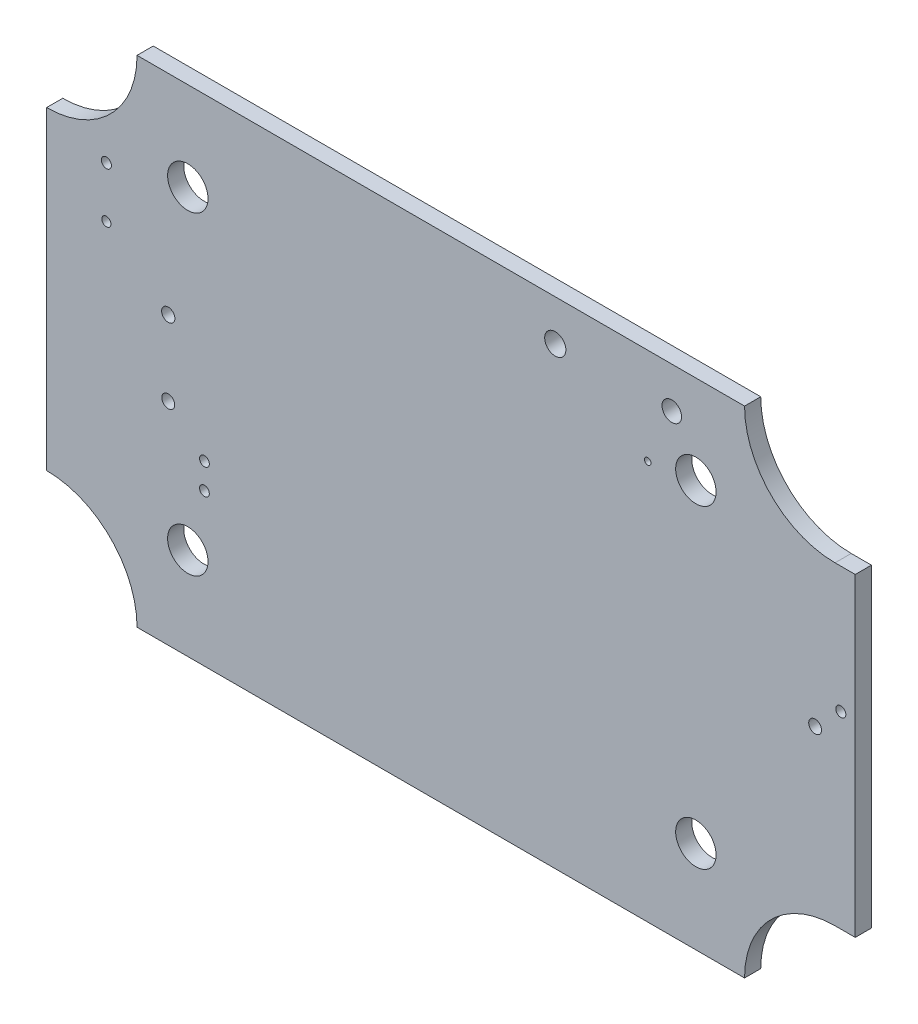
ISO-10303-21;
HEADER;
FILE_DESCRIPTION(('STEP AP214'),'2;1');
FILE_NAME('part.step','',(''),(''),'','','');
FILE_SCHEMA(('AUTOMOTIVE_DESIGN { 1 0 10303 214 1 1 1 1 }'));
ENDSEC;
DATA;
#1=APPLICATION_CONTEXT('core data for automotive mechanical design processes');
#2=APPLICATION_PROTOCOL_DEFINITION('international standard','automotive_design',2000,#1);
#3=PRODUCT_CONTEXT('',#1,'mechanical');
#4=PRODUCT('Part','Part','',(#3));
#5=PRODUCT_RELATED_PRODUCT_CATEGORY('part','',(#4));
#6=PRODUCT_DEFINITION_FORMATION('','',#4);
#7=PRODUCT_DEFINITION_CONTEXT('part definition',#1,'design');
#8=PRODUCT_DEFINITION('design','',#6,#7);
#9=PRODUCT_DEFINITION_SHAPE('','',#8);
#10=(LENGTH_UNIT() NAMED_UNIT(*) SI_UNIT(.MILLI.,.METRE.));
#11=(NAMED_UNIT(*) PLANE_ANGLE_UNIT() SI_UNIT($,.RADIAN.));
#12=(NAMED_UNIT(*) SI_UNIT($,.STERADIAN.) SOLID_ANGLE_UNIT());
#13=UNCERTAINTY_MEASURE_WITH_UNIT(LENGTH_MEASURE(1.E-05),#10,'distance_accuracy_value','');
#14=(GEOMETRIC_REPRESENTATION_CONTEXT(3) GLOBAL_UNCERTAINTY_ASSIGNED_CONTEXT((#13)) GLOBAL_UNIT_ASSIGNED_CONTEXT((#10,
#11,#12)) REPRESENTATION_CONTEXT('',''));
#15=CARTESIAN_POINT('',(0.,0.,0.));
#16=DIRECTION('',(0.,0.,1.));
#17=DIRECTION('',(1.,0.,0.));
#18=AXIS2_PLACEMENT_3D('',#15,#16,#17);
#19=CARTESIAN_POINT('',(-39.,24.5,1.6));
#20=DIRECTION('',(0.,-1.,0.));
#21=DIRECTION('',(0.,0.,-1.));
#22=AXIS2_PLACEMENT_3D('',#19,#20,#21);
#23=PLANE('',#22);
#24=DIRECTION('',(-1.,0.,0.));
#25=VECTOR('',#24,1.);
#26=CARTESIAN_POINT('',(-39.,24.5,0.));
#27=LINE('',#26,#25);
#28=CARTESIAN_POINT('',(30.0488040978267,24.5,0.));
#29=VERTEX_POINT('',#28);
#30=CARTESIAN_POINT('',(-30.0488040978267,24.5,0.));
#31=VERTEX_POINT('',#30);
#32=EDGE_CURVE('E191',#29,#31,#27,.T.);
#33=ORIENTED_EDGE('',*,*,#32,.T.);
#34=DIRECTION('',(0.,0.,1.));
#35=VECTOR('',#34,1.);
#36=CARTESIAN_POINT('',(-30.0488040978267,24.5,-8.4));
#37=LINE('',#36,#35);
#38=CARTESIAN_POINT('',(-30.0488040978267,24.5,1.6));
#39=VERTEX_POINT('',#38);
#40=EDGE_CURVE('E54',#31,#39,#37,.T.);
#41=ORIENTED_EDGE('',*,*,#40,.T.);
#42=DIRECTION('',(-1.,0.,0.));
#43=VECTOR('',#42,1.);
#44=CARTESIAN_POINT('',(-39.,24.5,1.6));
#45=LINE('',#44,#43);
#46=CARTESIAN_POINT('',(30.0488040978267,24.5,1.6));
#47=VERTEX_POINT('',#46);
#48=EDGE_CURVE('E192',#47,#39,#45,.T.);
#49=ORIENTED_EDGE('',*,*,#48,.F.);
#50=DIRECTION('',(0.,0.,1.));
#51=VECTOR('',#50,1.);
#52=CARTESIAN_POINT('',(30.0488040978267,24.5,-8.4));
#53=LINE('',#52,#51);
#54=EDGE_CURVE('E164',#47,#29,#53,.F.);
#55=ORIENTED_EDGE('',*,*,#54,.T.);
#56=EDGE_LOOP('',(#33,#41,#49,#55));
#57=FACE_BOUND('',#56,.T.);
#58=ADVANCED_FACE('F37',(#57),#23,.F.);
#59=CARTESIAN_POINT('',(-39.,24.5,1.6));
#60=DIRECTION('',(1.,0.,0.));
#61=DIRECTION('',(0.,0.,-1.));
#62=AXIS2_PLACEMENT_3D('',#59,#60,#61);
#63=PLANE('',#62);
#64=DIRECTION('',(0.,-1.,0.));
#65=VECTOR('',#64,1.);
#66=CARTESIAN_POINT('',(-39.,24.5,1.6));
#67=LINE('',#66,#65);
#68=CARTESIAN_POINT('',(-39.,15.5488040978268,1.6));
#69=VERTEX_POINT('',#68);
#70=CARTESIAN_POINT('',(-39.,-15.5488040978267,1.6));
#71=VERTEX_POINT('',#70);
#72=EDGE_CURVE('E196',#69,#71,#67,.T.);
#73=ORIENTED_EDGE('',*,*,#72,.F.);
#74=DIRECTION('',(0.,0.,1.));
#75=VECTOR('',#74,1.);
#76=CARTESIAN_POINT('',(-39.,15.5488040978268,-8.4));
#77=LINE('',#76,#75);
#78=CARTESIAN_POINT('',(-39.,15.5488040978268,0.));
#79=VERTEX_POINT('',#78);
#80=EDGE_CURVE('E178',#69,#79,#77,.F.);
#81=ORIENTED_EDGE('',*,*,#80,.T.);
#82=DIRECTION('',(0.,-1.,0.));
#83=VECTOR('',#82,1.);
#84=CARTESIAN_POINT('',(-39.,24.5,0.));
#85=LINE('',#84,#83);
#86=CARTESIAN_POINT('',(-39.,-15.5488040978267,0.));
#87=VERTEX_POINT('',#86);
#88=EDGE_CURVE('E208',#79,#87,#85,.T.);
#89=ORIENTED_EDGE('',*,*,#88,.T.);
#90=DIRECTION('',(0.,0.,1.));
#91=VECTOR('',#90,1.);
#92=CARTESIAN_POINT('',(-39.,-15.5488040978267,-8.4));
#93=LINE('',#92,#91);
#94=EDGE_CURVE('E62',#87,#71,#93,.T.);
#95=ORIENTED_EDGE('',*,*,#94,.T.);
#96=EDGE_LOOP('',(#73,#81,#89,#95));
#97=FACE_BOUND('',#96,.T.);
#98=ADVANCED_FACE('F324',(#97),#63,.F.);
#99=CARTESIAN_POINT('',(-39.,-24.5,1.6));
#100=DIRECTION('',(0.,1.,0.));
#101=DIRECTION('',(0.,0.,1.));
#102=AXIS2_PLACEMENT_3D('',#99,#100,#101);
#103=PLANE('',#102);
#104=DIRECTION('',(1.,0.,0.));
#105=VECTOR('',#104,1.);
#106=CARTESIAN_POINT('',(-39.,-24.5,0.));
#107=LINE('',#106,#105);
#108=CARTESIAN_POINT('',(-30.0488040978267,-24.5,0.));
#109=VERTEX_POINT('',#108);
#110=CARTESIAN_POINT('',(30.0488040978267,-24.5,0.));
#111=VERTEX_POINT('',#110);
#112=EDGE_CURVE('E197',#109,#111,#107,.T.);
#113=ORIENTED_EDGE('',*,*,#112,.T.);
#114=DIRECTION('',(0.,0.,1.));
#115=VECTOR('',#114,1.);
#116=CARTESIAN_POINT('',(30.0488040978267,-24.5,-8.4));
#117=LINE('',#116,#115);
#118=CARTESIAN_POINT('',(30.0488040978267,-24.5,1.6));
#119=VERTEX_POINT('',#118);
#120=EDGE_CURVE('E184',#111,#119,#117,.T.);
#121=ORIENTED_EDGE('',*,*,#120,.T.);
#122=DIRECTION('',(1.,0.,0.));
#123=VECTOR('',#122,1.);
#124=CARTESIAN_POINT('',(-39.,-24.5,1.6));
#125=LINE('',#124,#123);
#126=CARTESIAN_POINT('',(-30.0488040978267,-24.5,1.6));
#127=VERTEX_POINT('',#126);
#128=EDGE_CURVE('E201',#127,#119,#125,.T.);
#129=ORIENTED_EDGE('',*,*,#128,.F.);
#130=DIRECTION('',(0.,0.,1.));
#131=VECTOR('',#130,1.);
#132=CARTESIAN_POINT('',(-30.0488040978267,-24.5,-8.4));
#133=LINE('',#132,#131);
#134=EDGE_CURVE('E172',#127,#109,#133,.F.);
#135=ORIENTED_EDGE('',*,*,#134,.T.);
#136=EDGE_LOOP('',(#113,#121,#129,#135));
#137=FACE_BOUND('',#136,.T.);
#138=ADVANCED_FACE('F330',(#137),#103,.F.);
#139=CARTESIAN_POINT('',(0.,0.,1.6));
#140=DIRECTION('',(0.,0.,1.));
#141=DIRECTION('',(1.,0.,0.));
#142=AXIS2_PLACEMENT_3D('',#139,#140,#141);
#143=PLANE('',#142);
#144=CARTESIAN_POINT('',(25.2329398781422,15.7209690714798,1.6));
#145=DIRECTION('',(0.,0.,1.));
#146=DIRECTION('',(1.,0.,0.));
#147=AXIS2_PLACEMENT_3D('',#144,#145,#146);
#148=CIRCLE('',#147,2.);
#149=CARTESIAN_POINT('',(27.2329398781422,15.7209690714798,1.6));
#150=VERTEX_POINT('',#149);
#151=EDGE_CURVE('E494',#150,#150,#148,.T.);
#152=ORIENTED_EDGE('',*,*,#151,.F.);
#153=EDGE_LOOP('',(#152));
#154=FACE_BOUND('',#153,.T.);
#155=CARTESIAN_POINT('',(-25.0280466784542,15.7209690714798,1.6));
#156=DIRECTION('',(0.,0.,1.));
#157=DIRECTION('',(1.,0.,0.));
#158=AXIS2_PLACEMENT_3D('',#155,#156,#157);
#159=CIRCLE('',#158,2.);
#160=CARTESIAN_POINT('',(-23.0280466784542,15.7209690714798,1.6));
#161=VERTEX_POINT('',#160);
#162=EDGE_CURVE('E498',#161,#161,#159,.T.);
#163=ORIENTED_EDGE('',*,*,#162,.F.);
#164=EDGE_LOOP('',(#163));
#165=FACE_BOUND('',#164,.T.);
#166=CARTESIAN_POINT('',(-25.0280466784542,-15.3766391241737,1.6));
#167=DIRECTION('',(0.,0.,1.));
#168=DIRECTION('',(1.,0.,0.));
#169=AXIS2_PLACEMENT_3D('',#166,#167,#168);
#170=CIRCLE('',#169,2.);
#171=CARTESIAN_POINT('',(-23.0280466784541,-15.3766391241737,1.6));
#172=VERTEX_POINT('',#171);
#173=EDGE_CURVE('E432',#172,#172,#170,.T.);
#174=ORIENTED_EDGE('',*,*,#173,.F.);
#175=EDGE_LOOP('',(#174));
#176=FACE_BOUND('',#175,.T.);
#177=CARTESIAN_POINT('',(25.2329398781421,-15.3766391241736,1.6));
#178=DIRECTION('',(0.,0.,1.));
#179=DIRECTION('',(1.,0.,0.));
#180=AXIS2_PLACEMENT_3D('',#177,#178,#179);
#181=CIRCLE('',#180,2.);
#182=CARTESIAN_POINT('',(27.2329398781421,-15.3766391241736,1.6));
#183=VERTEX_POINT('',#182);
#184=EDGE_CURVE('E228',#183,#183,#181,.T.);
#185=ORIENTED_EDGE('',*,*,#184,.F.);
#186=EDGE_LOOP('',(#185));
#187=FACE_BOUND('',#186,.T.);
#188=CARTESIAN_POINT('',(37.0308515376882,0.541777689190686,1.6));
#189=DIRECTION('',(0.,0.,1.));
#190=DIRECTION('',(1.,0.,0.));
#191=AXIS2_PLACEMENT_3D('',#188,#189,#190);
#192=CIRCLE('',#191,0.635000000000452);
#193=CARTESIAN_POINT('',(37.6658515376886,0.541777689190686,1.6));
#194=VERTEX_POINT('',#193);
#195=EDGE_CURVE('E138',#194,#194,#192,.T.);
#196=ORIENTED_EDGE('',*,*,#195,.F.);
#197=EDGE_LOOP('',(#196));
#198=FACE_BOUND('',#197,.T.);
#199=CARTESIAN_POINT('',(39.5708515376882,3.08177768919067,1.6));
#200=DIRECTION('',(0.,0.,1.));
#201=DIRECTION('',(1.,0.,0.));
#202=AXIS2_PLACEMENT_3D('',#199,#200,#201);
#203=CIRCLE('',#202,0.500000000003366);
#204=CARTESIAN_POINT('',(40.0708515376916,3.08177768919067,1.6));
#205=VERTEX_POINT('',#204);
#206=EDGE_CURVE('E295',#205,#205,#203,.T.);
#207=ORIENTED_EDGE('',*,*,#206,.F.);
#208=EDGE_LOOP('',(#207));
#209=FACE_BOUND('',#208,.T.);
#210=CARTESIAN_POINT('',(11.3235204504078,20.4633443510087,1.6));
#211=DIRECTION('',(0.,0.,1.));
#212=DIRECTION('',(1.,0.,0.));
#213=AXIS2_PLACEMENT_3D('',#210,#211,#212);
#214=CIRCLE('',#213,1.04879219349604);
#215=CARTESIAN_POINT('',(12.3723126439038,20.4633443510087,1.6));
#216=VERTEX_POINT('',#215);
#217=EDGE_CURVE('E291',#216,#216,#214,.T.);
#218=ORIENTED_EDGE('',*,*,#217,.F.);
#219=EDGE_LOOP('',(#218));
#220=FACE_BOUND('',#219,.T.);
#221=CARTESIAN_POINT('',(20.4696859422281,14.9792530107455,1.6));
#222=DIRECTION('',(0.,0.,1.));
#223=DIRECTION('',(1.,0.,0.));
#224=AXIS2_PLACEMENT_3D('',#221,#222,#223);
#225=CIRCLE('',#224,0.324209477854509);
#226=CARTESIAN_POINT('',(20.7938954200826,14.9792530107455,1.6));
#227=VERTEX_POINT('',#226);
#228=EDGE_CURVE('E288',#227,#227,#225,.T.);
#229=ORIENTED_EDGE('',*,*,#228,.F.);
#230=EDGE_LOOP('',(#229));
#231=FACE_BOUND('',#230,.T.);
#232=CARTESIAN_POINT('',(-26.9636920390975,-3.59633731280298,1.6));
#233=DIRECTION('',(0.,0.,1.));
#234=DIRECTION('',(1.,0.,0.));
#235=AXIS2_PLACEMENT_3D('',#232,#233,#234);
#236=CIRCLE('',#235,0.640689511386);
#237=CARTESIAN_POINT('',(-26.3230025277115,-3.59633731280298,1.6));
#238=VERTEX_POINT('',#237);
#239=EDGE_CURVE('E285',#238,#238,#236,.T.);
#240=ORIENTED_EDGE('',*,*,#239,.F.);
#241=EDGE_LOOP('',(#240));
#242=FACE_BOUND('',#241,.T.);
#243=CARTESIAN_POINT('',(-26.9636920390975,3.82046268719701,1.6));
#244=DIRECTION('',(0.,0.,1.));
#245=DIRECTION('',(1.,0.,0.));
#246=AXIS2_PLACEMENT_3D('',#243,#244,#245);
#247=CIRCLE('',#246,0.655195162035507);
#248=CARTESIAN_POINT('',(-26.308496877062,3.82046268719701,1.6));
#249=VERTEX_POINT('',#248);
#250=EDGE_CURVE('E281',#249,#249,#247,.T.);
#251=ORIENTED_EDGE('',*,*,#250,.F.);
#252=EDGE_LOOP('',(#251));
#253=FACE_BOUND('',#252,.T.);
#254=CARTESIAN_POINT('',(-33.0838916471721,8.74458215396742,1.6));
#255=DIRECTION('',(0.,0.,1.));
#256=DIRECTION('',(1.,0.,0.));
#257=AXIS2_PLACEMENT_3D('',#254,#255,#256);
#258=CIRCLE('',#257,0.453768234493944);
#259=CARTESIAN_POINT('',(-32.6301234126781,8.74458215396742,1.6));
#260=VERTEX_POINT('',#259);
#261=EDGE_CURVE('E277',#260,#260,#258,.T.);
#262=ORIENTED_EDGE('',*,*,#261,.F.);
#263=EDGE_LOOP('',(#262));
#264=FACE_BOUND('',#263,.T.);
#265=CARTESIAN_POINT('',(-33.0838916471721,13.7783503884613,1.6));
#266=DIRECTION('',(0.,0.,1.));
#267=DIRECTION('',(1.,0.,0.));
#268=AXIS2_PLACEMENT_3D('',#265,#266,#267);
#269=CIRCLE('',#268,0.499999999999999);
#270=CARTESIAN_POINT('',(-32.5838916471721,13.7783503884613,1.6));
#271=VERTEX_POINT('',#270);
#272=EDGE_CURVE('E273',#271,#271,#269,.T.);
#273=ORIENTED_EDGE('',*,*,#272,.F.);
#274=EDGE_LOOP('',(#273));
#275=FACE_BOUND('',#274,.T.);
#276=CARTESIAN_POINT('',(-23.383432149221,-9.48059258202134,1.6));
#277=DIRECTION('',(0.,0.,1.));
#278=DIRECTION('',(1.,0.,0.));
#279=AXIS2_PLACEMENT_3D('',#276,#277,#278);
#280=CIRCLE('',#279,0.482600000000028);
#281=CARTESIAN_POINT('',(-22.9008321492209,-9.48059258202134,1.6));
#282=VERTEX_POINT('',#281);
#283=EDGE_CURVE('E269',#282,#282,#280,.T.);
#284=ORIENTED_EDGE('',*,*,#283,.F.);
#285=EDGE_LOOP('',(#284));
#286=FACE_BOUND('',#285,.T.);
#287=CARTESIAN_POINT('',(-23.3834321492209,-6.94059258202135,1.6));
#288=DIRECTION('',(0.,0.,1.));
#289=DIRECTION('',(1.,0.,0.));
#290=AXIS2_PLACEMENT_3D('',#287,#288,#289);
#291=CIRCLE('',#290,0.482599999999992);
#292=CARTESIAN_POINT('',(-22.9008321492209,-6.94059258202135,1.6));
#293=VERTEX_POINT('',#292);
#294=EDGE_CURVE('E265',#293,#293,#291,.T.);
#295=ORIENTED_EDGE('',*,*,#294,.F.);
#296=EDGE_LOOP('',(#295));
#297=FACE_BOUND('',#296,.T.);
#298=CARTESIAN_POINT('',(22.8509361294476,20.4633443510087,1.6));
#299=DIRECTION('',(0.,0.,1.));
#300=DIRECTION('',(1.,0.,0.));
#301=AXIS2_PLACEMENT_3D('',#298,#299,#300);
#302=CIRCLE('',#301,0.968115870919405);
#303=CARTESIAN_POINT('',(23.819052000367,20.4633443510087,1.6));
#304=VERTEX_POINT('',#303);
#305=EDGE_CURVE('E260',#304,#304,#302,.T.);
#306=ORIENTED_EDGE('',*,*,#305,.F.);
#307=EDGE_LOOP('',(#306));
#308=FACE_BOUND('',#307,.T.);
#309=CARTESIAN_POINT('',(39.,-24.5,1.6));
#310=DIRECTION('',(0.,0.,1.));
#311=DIRECTION('',(1.,0.,0.));
#312=AXIS2_PLACEMENT_3D('',#309,#310,#311);
#313=CIRCLE('',#312,8.95119590217326);
#314=CARTESIAN_POINT('',(39.,-15.5488040978267,1.6));
#315=VERTEX_POINT('',#314);
#316=EDGE_CURVE('E143',#315,#119,#313,.T.);
#317=ORIENTED_EDGE('',*,*,#316,.F.);
#318=DIRECTION('',(-1.,0.,0.));
#319=VECTOR('',#318,1.);
#320=CARTESIAN_POINT('',(41.,-15.5488040978267,1.6));
#321=LINE('',#320,#319);
#322=CARTESIAN_POINT('',(41.,-15.5488040978267,1.6));
#323=VERTEX_POINT('',#322);
#324=EDGE_CURVE('E121',#323,#315,#321,.T.);
#325=ORIENTED_EDGE('',*,*,#324,.F.);
#326=DIRECTION('',(0.,-1.,0.));
#327=VECTOR('',#326,1.);
#328=CARTESIAN_POINT('',(41.,15.5488040978268,1.6));
#329=LINE('',#328,#327);
#330=CARTESIAN_POINT('',(41.,15.5488040978268,1.6));
#331=VERTEX_POINT('',#330);
#332=EDGE_CURVE('E128',#331,#323,#329,.T.);
#333=ORIENTED_EDGE('',*,*,#332,.F.);
#334=DIRECTION('',(-1.,0.,0.));
#335=VECTOR('',#334,1.);
#336=CARTESIAN_POINT('',(41.,15.5488040978268,1.6));
#337=LINE('',#336,#335);
#338=CARTESIAN_POINT('',(39.,15.5488040978268,1.6));
#339=VERTEX_POINT('',#338);
#340=EDGE_CURVE('E305',#331,#339,#337,.T.);
#341=ORIENTED_EDGE('',*,*,#340,.T.);
#342=CARTESIAN_POINT('',(39.,24.5,1.6));
#343=DIRECTION('',(0.,0.,1.));
#344=DIRECTION('',(1.,0.,0.));
#345=AXIS2_PLACEMENT_3D('',#342,#343,#344);
#346=CIRCLE('',#345,8.95119590217326);
#347=EDGE_CURVE('E159',#47,#339,#346,.T.);
#348=ORIENTED_EDGE('',*,*,#347,.F.);
#349=ORIENTED_EDGE('',*,*,#48,.T.);
#350=CARTESIAN_POINT('',(-39.,24.5,1.6));
#351=DIRECTION('',(0.,0.,1.));
#352=DIRECTION('',(1.,0.,0.));
#353=AXIS2_PLACEMENT_3D('',#350,#351,#352);
#354=CIRCLE('',#353,8.95119590217326);
#355=EDGE_CURVE('E150',#69,#39,#354,.T.);
#356=ORIENTED_EDGE('',*,*,#355,.F.);
#357=ORIENTED_EDGE('',*,*,#72,.T.);
#358=CARTESIAN_POINT('',(-39.,-24.5,1.6));
#359=DIRECTION('',(0.,0.,1.));
#360=DIRECTION('',(1.,0.,0.));
#361=AXIS2_PLACEMENT_3D('',#358,#359,#360);
#362=CIRCLE('',#361,8.95119590217326);
#363=EDGE_CURVE('E145',#127,#71,#362,.T.);
#364=ORIENTED_EDGE('',*,*,#363,.F.);
#365=ORIENTED_EDGE('',*,*,#128,.T.);
#366=EDGE_LOOP('',(#317,#325,#333,#341,#348,#349,#356,#357,#364,#365));
#367=FACE_BOUND('',#366,.T.);
#368=ADVANCED_FACE('F141',(#154,#165,#176,#187,#198,#209,#220,#231,#242,#253,#264,#275,#286,
#297,#308,#367),#143,.T.);
#369=CARTESIAN_POINT('',(0.,0.,0.));
#370=DIRECTION('',(0.,0.,1.));
#371=DIRECTION('',(1.,0.,0.));
#372=AXIS2_PLACEMENT_3D('',#369,#370,#371);
#373=PLANE('',#372);
#374=CARTESIAN_POINT('',(25.2329398781422,15.7209690714798,0.));
#375=DIRECTION('',(0.,0.,1.));
#376=DIRECTION('',(1.,0.,0.));
#377=AXIS2_PLACEMENT_3D('',#374,#375,#376);
#378=CIRCLE('',#377,2.);
#379=CARTESIAN_POINT('',(27.2329398781422,15.7209690714798,0.));
#380=VERTEX_POINT('',#379);
#381=EDGE_CURVE('E40',#380,#380,#378,.T.);
#382=ORIENTED_EDGE('',*,*,#381,.T.);
#383=EDGE_LOOP('',(#382));
#384=FACE_BOUND('',#383,.T.);
#385=CARTESIAN_POINT('',(-25.0280466784542,15.7209690714798,0.));
#386=DIRECTION('',(0.,0.,1.));
#387=DIRECTION('',(1.,0.,0.));
#388=AXIS2_PLACEMENT_3D('',#385,#386,#387);
#389=CIRCLE('',#388,2.);
#390=CARTESIAN_POINT('',(-23.0280466784542,15.7209690714798,0.));
#391=VERTEX_POINT('',#390);
#392=EDGE_CURVE('E230',#391,#391,#389,.T.);
#393=ORIENTED_EDGE('',*,*,#392,.T.);
#394=EDGE_LOOP('',(#393));
#395=FACE_BOUND('',#394,.T.);
#396=CARTESIAN_POINT('',(-25.0280466784542,-15.3766391241737,0.));
#397=DIRECTION('',(0.,0.,1.));
#398=DIRECTION('',(1.,0.,0.));
#399=AXIS2_PLACEMENT_3D('',#396,#397,#398);
#400=CIRCLE('',#399,2.);
#401=CARTESIAN_POINT('',(-23.0280466784541,-15.3766391241737,0.));
#402=VERTEX_POINT('',#401);
#403=EDGE_CURVE('E227',#402,#402,#400,.T.);
#404=ORIENTED_EDGE('',*,*,#403,.T.);
#405=EDGE_LOOP('',(#404));
#406=FACE_BOUND('',#405,.T.);
#407=CARTESIAN_POINT('',(25.2329398781421,-15.3766391241736,0.));
#408=DIRECTION('',(0.,0.,1.));
#409=DIRECTION('',(1.,0.,0.));
#410=AXIS2_PLACEMENT_3D('',#407,#408,#409);
#411=CIRCLE('',#410,2.);
#412=CARTESIAN_POINT('',(27.2329398781421,-15.3766391241736,0.));
#413=VERTEX_POINT('',#412);
#414=EDGE_CURVE('E223',#413,#413,#411,.T.);
#415=ORIENTED_EDGE('',*,*,#414,.T.);
#416=EDGE_LOOP('',(#415));
#417=FACE_BOUND('',#416,.T.);
#418=CARTESIAN_POINT('',(37.0308515376882,0.541777689190686,0.));
#419=DIRECTION('',(0.,0.,-1.));
#420=DIRECTION('',(1.,0.,0.));
#421=AXIS2_PLACEMENT_3D('',#418,#419,#420);
#422=CIRCLE('',#421,0.635000000000452);
#423=CARTESIAN_POINT('',(37.6658515376886,0.541777689190686,0.));
#424=VERTEX_POINT('',#423);
#425=EDGE_CURVE('E238',#424,#424,#422,.T.);
#426=ORIENTED_EDGE('',*,*,#425,.F.);
#427=EDGE_LOOP('',(#426));
#428=FACE_BOUND('',#427,.T.);
#429=CARTESIAN_POINT('',(39.5708515376882,3.08177768919067,0.));
#430=DIRECTION('',(0.,0.,-1.));
#431=DIRECTION('',(1.,0.,0.));
#432=AXIS2_PLACEMENT_3D('',#429,#430,#431);
#433=CIRCLE('',#432,0.500000000003366);
#434=CARTESIAN_POINT('',(40.0708515376916,3.08177768919067,0.));
#435=VERTEX_POINT('',#434);
#436=EDGE_CURVE('E244',#435,#435,#433,.T.);
#437=ORIENTED_EDGE('',*,*,#436,.F.);
#438=EDGE_LOOP('',(#437));
#439=FACE_BOUND('',#438,.T.);
#440=CARTESIAN_POINT('',(11.3235204504078,20.4633443510087,0.));
#441=DIRECTION('',(0.,0.,-1.));
#442=DIRECTION('',(1.,0.,0.));
#443=AXIS2_PLACEMENT_3D('',#440,#441,#442);
#444=CIRCLE('',#443,1.04879219349604);
#445=CARTESIAN_POINT('',(12.3723126439038,20.4633443510087,0.));
#446=VERTEX_POINT('',#445);
#447=EDGE_CURVE('E261',#446,#446,#444,.T.);
#448=ORIENTED_EDGE('',*,*,#447,.F.);
#449=EDGE_LOOP('',(#448));
#450=FACE_BOUND('',#449,.T.);
#451=CARTESIAN_POINT('',(20.4696859422281,14.9792530107455,0.));
#452=DIRECTION('',(0.,0.,-1.));
#453=DIRECTION('',(1.,0.,0.));
#454=AXIS2_PLACEMENT_3D('',#451,#452,#453);
#455=CIRCLE('',#454,0.324209477854509);
#456=CARTESIAN_POINT('',(20.7938954200826,14.9792530107455,0.));
#457=VERTEX_POINT('',#456);
#458=EDGE_CURVE('E447',#457,#457,#455,.T.);
#459=ORIENTED_EDGE('',*,*,#458,.F.);
#460=EDGE_LOOP('',(#459));
#461=FACE_BOUND('',#460,.T.);
#462=CARTESIAN_POINT('',(-26.9636920390975,-3.59633731280298,0.));
#463=DIRECTION('',(0.,0.,-1.));
#464=DIRECTION('',(1.,0.,0.));
#465=AXIS2_PLACEMENT_3D('',#462,#463,#464);
#466=CIRCLE('',#465,0.640689511386);
#467=CARTESIAN_POINT('',(-26.3230025277115,-3.59633731280298,0.));
#468=VERTEX_POINT('',#467);
#469=EDGE_CURVE('E451',#468,#468,#466,.T.);
#470=ORIENTED_EDGE('',*,*,#469,.F.);
#471=EDGE_LOOP('',(#470));
#472=FACE_BOUND('',#471,.T.);
#473=CARTESIAN_POINT('',(-26.9636920390975,3.82046268719701,0.));
#474=DIRECTION('',(0.,0.,-1.));
#475=DIRECTION('',(1.,0.,0.));
#476=AXIS2_PLACEMENT_3D('',#473,#474,#475);
#477=CIRCLE('',#476,0.655195162035507);
#478=CARTESIAN_POINT('',(-26.308496877062,3.82046268719701,0.));
#479=VERTEX_POINT('',#478);
#480=EDGE_CURVE('E455',#479,#479,#477,.T.);
#481=ORIENTED_EDGE('',*,*,#480,.F.);
#482=EDGE_LOOP('',(#481));
#483=FACE_BOUND('',#482,.T.);
#484=CARTESIAN_POINT('',(-33.0838916471721,8.74458215396742,0.));
#485=DIRECTION('',(0.,0.,-1.));
#486=DIRECTION('',(1.,0.,0.));
#487=AXIS2_PLACEMENT_3D('',#484,#485,#486);
#488=CIRCLE('',#487,0.453768234493944);
#489=CARTESIAN_POINT('',(-32.6301234126781,8.74458215396742,0.));
#490=VERTEX_POINT('',#489);
#491=EDGE_CURVE('E459',#490,#490,#488,.T.);
#492=ORIENTED_EDGE('',*,*,#491,.F.);
#493=EDGE_LOOP('',(#492));
#494=FACE_BOUND('',#493,.T.);
#495=CARTESIAN_POINT('',(-33.0838916471721,13.7783503884613,0.));
#496=DIRECTION('',(0.,0.,-1.));
#497=DIRECTION('',(1.,0.,0.));
#498=AXIS2_PLACEMENT_3D('',#495,#496,#497);
#499=CIRCLE('',#498,0.499999999999999);
#500=CARTESIAN_POINT('',(-32.5838916471721,13.7783503884613,0.));
#501=VERTEX_POINT('',#500);
#502=EDGE_CURVE('E463',#501,#501,#499,.T.);
#503=ORIENTED_EDGE('',*,*,#502,.F.);
#504=EDGE_LOOP('',(#503));
#505=FACE_BOUND('',#504,.T.);
#506=CARTESIAN_POINT('',(-23.383432149221,-9.48059258202134,0.));
#507=DIRECTION('',(0.,0.,-1.));
#508=DIRECTION('',(1.,0.,0.));
#509=AXIS2_PLACEMENT_3D('',#506,#507,#508);
#510=CIRCLE('',#509,0.482600000000028);
#511=CARTESIAN_POINT('',(-22.9008321492209,-9.48059258202134,0.));
#512=VERTEX_POINT('',#511);
#513=EDGE_CURVE('E467',#512,#512,#510,.T.);
#514=ORIENTED_EDGE('',*,*,#513,.F.);
#515=EDGE_LOOP('',(#514));
#516=FACE_BOUND('',#515,.T.);
#517=CARTESIAN_POINT('',(-23.3834321492209,-6.94059258202135,0.));
#518=DIRECTION('',(0.,0.,-1.));
#519=DIRECTION('',(1.,0.,0.));
#520=AXIS2_PLACEMENT_3D('',#517,#518,#519);
#521=CIRCLE('',#520,0.482599999999992);
#522=CARTESIAN_POINT('',(-22.9008321492209,-6.94059258202135,0.));
#523=VERTEX_POINT('',#522);
#524=EDGE_CURVE('E252',#523,#523,#521,.T.);
#525=ORIENTED_EDGE('',*,*,#524,.F.);
#526=EDGE_LOOP('',(#525));
#527=FACE_BOUND('',#526,.T.);
#528=CARTESIAN_POINT('',(22.8509361294476,20.4633443510087,0.));
#529=DIRECTION('',(0.,0.,-1.));
#530=DIRECTION('',(1.,0.,0.));
#531=AXIS2_PLACEMENT_3D('',#528,#529,#530);
#532=CIRCLE('',#531,0.968115870919405);
#533=CARTESIAN_POINT('',(23.819052000367,20.4633443510087,0.));
#534=VERTEX_POINT('',#533);
#535=EDGE_CURVE('E256',#534,#534,#532,.T.);
#536=ORIENTED_EDGE('',*,*,#535,.F.);
#537=EDGE_LOOP('',(#536));
#538=FACE_BOUND('',#537,.T.);
#539=CARTESIAN_POINT('',(39.,24.5,0.));
#540=DIRECTION('',(0.,0.,1.));
#541=DIRECTION('',(1.,0.,0.));
#542=AXIS2_PLACEMENT_3D('',#539,#540,#541);
#543=CIRCLE('',#542,8.95119590217326);
#544=CARTESIAN_POINT('',(39.,15.5488040978268,0.));
#545=VERTEX_POINT('',#544);
#546=EDGE_CURVE('E204',#29,#545,#543,.T.);
#547=ORIENTED_EDGE('',*,*,#546,.T.);
#548=DIRECTION('',(-1.,0.,0.));
#549=VECTOR('',#548,1.);
#550=CARTESIAN_POINT('',(41.,15.5488040978268,0.));
#551=LINE('',#550,#549);
#552=CARTESIAN_POINT('',(41.,15.5488040978268,0.));
#553=VERTEX_POINT('',#552);
#554=EDGE_CURVE('E153',#553,#545,#551,.T.);
#555=ORIENTED_EDGE('',*,*,#554,.F.);
#556=DIRECTION('',(0.,1.,0.));
#557=VECTOR('',#556,1.);
#558=CARTESIAN_POINT('',(41.,15.5488040978268,0.));
#559=LINE('',#558,#557);
#560=CARTESIAN_POINT('',(41.,-15.5488040978267,0.));
#561=VERTEX_POINT('',#560);
#562=EDGE_CURVE('E127',#561,#553,#559,.T.);
#563=ORIENTED_EDGE('',*,*,#562,.F.);
#564=DIRECTION('',(-1.,0.,0.));
#565=VECTOR('',#564,1.);
#566=CARTESIAN_POINT('',(41.,-15.5488040978267,0.));
#567=LINE('',#566,#565);
#568=CARTESIAN_POINT('',(39.,-15.5488040978267,0.));
#569=VERTEX_POINT('',#568);
#570=EDGE_CURVE('E123',#561,#569,#567,.T.);
#571=ORIENTED_EDGE('',*,*,#570,.T.);
#572=CARTESIAN_POINT('',(39.,-24.5,0.));
#573=DIRECTION('',(0.,0.,1.));
#574=DIRECTION('',(1.,0.,0.));
#575=AXIS2_PLACEMENT_3D('',#572,#573,#574);
#576=CIRCLE('',#575,8.95119590217326);
#577=EDGE_CURVE('E11',#569,#111,#576,.T.);
#578=ORIENTED_EDGE('',*,*,#577,.T.);
#579=ORIENTED_EDGE('',*,*,#112,.F.);
#580=CARTESIAN_POINT('',(-39.,-24.5,0.));
#581=DIRECTION('',(0.,0.,1.));
#582=DIRECTION('',(1.,0.,0.));
#583=AXIS2_PLACEMENT_3D('',#580,#581,#582);
#584=CIRCLE('',#583,8.95119590217326);
#585=EDGE_CURVE('E218',#109,#87,#584,.T.);
#586=ORIENTED_EDGE('',*,*,#585,.T.);
#587=ORIENTED_EDGE('',*,*,#88,.F.);
#588=CARTESIAN_POINT('',(-39.,24.5,0.));
#589=DIRECTION('',(0.,0.,1.));
#590=DIRECTION('',(1.,0.,0.));
#591=AXIS2_PLACEMENT_3D('',#588,#589,#590);
#592=CIRCLE('',#591,8.95119590217326);
#593=EDGE_CURVE('E46',#79,#31,#592,.T.);
#594=ORIENTED_EDGE('',*,*,#593,.T.);
#595=ORIENTED_EDGE('',*,*,#32,.F.);
#596=EDGE_LOOP('',(#547,#555,#563,#571,#578,#579,#586,#587,#594,#595));
#597=FACE_BOUND('',#596,.T.);
#598=ADVANCED_FACE('F313',(#384,#395,#406,#417,#428,#439,#450,#461,#472,#483,#494,#505,#516,
#527,#538,#597),#373,.F.);
#599=CARTESIAN_POINT('',(39.,24.5,-8.4));
#600=DIRECTION('',(0.,0.,1.));
#601=DIRECTION('',(1.,0.,0.));
#602=AXIS2_PLACEMENT_3D('',#599,#600,#601);
#603=CYLINDRICAL_SURFACE('',#602,8.95119590217326);
#604=ORIENTED_EDGE('',*,*,#546,.F.);
#605=ORIENTED_EDGE('',*,*,#54,.F.);
#606=ORIENTED_EDGE('',*,*,#347,.T.);
#607=DIRECTION('',(0.,0.,1.));
#608=VECTOR('',#607,1.);
#609=CARTESIAN_POINT('',(39.,15.5488040978268,-8.4));
#610=LINE('',#609,#608);
#611=EDGE_CURVE('E168',#545,#339,#610,.T.);
#612=ORIENTED_EDGE('',*,*,#611,.F.);
#613=EDGE_LOOP('',(#604,#605,#606,#612));
#614=FACE_BOUND('',#613,.T.);
#615=ADVANCED_FACE('F316',(#614),#603,.F.);
#616=CARTESIAN_POINT('',(-39.,-24.5,-8.4));
#617=DIRECTION('',(0.,0.,1.));
#618=DIRECTION('',(1.,0.,0.));
#619=AXIS2_PLACEMENT_3D('',#616,#617,#618);
#620=CYLINDRICAL_SURFACE('',#619,8.95119590217326);
#621=ORIENTED_EDGE('',*,*,#585,.F.);
#622=ORIENTED_EDGE('',*,*,#134,.F.);
#623=ORIENTED_EDGE('',*,*,#363,.T.);
#624=ORIENTED_EDGE('',*,*,#94,.F.);
#625=EDGE_LOOP('',(#621,#622,#623,#624));
#626=FACE_BOUND('',#625,.T.);
#627=ADVANCED_FACE('F327',(#626),#620,.F.);
#628=CARTESIAN_POINT('',(-39.,24.5,-8.4));
#629=DIRECTION('',(0.,0.,1.));
#630=DIRECTION('',(1.,0.,0.));
#631=AXIS2_PLACEMENT_3D('',#628,#629,#630);
#632=CYLINDRICAL_SURFACE('',#631,8.95119590217326);
#633=ORIENTED_EDGE('',*,*,#593,.F.);
#634=ORIENTED_EDGE('',*,*,#80,.F.);
#635=ORIENTED_EDGE('',*,*,#355,.T.);
#636=ORIENTED_EDGE('',*,*,#40,.F.);
#637=EDGE_LOOP('',(#633,#634,#635,#636));
#638=FACE_BOUND('',#637,.T.);
#639=ADVANCED_FACE('F334',(#638),#632,.F.);
#640=CARTESIAN_POINT('',(39.,-24.5,-8.4));
#641=DIRECTION('',(0.,0.,1.));
#642=DIRECTION('',(1.,0.,0.));
#643=AXIS2_PLACEMENT_3D('',#640,#641,#642);
#644=CYLINDRICAL_SURFACE('',#643,8.95119590217326);
#645=ORIENTED_EDGE('',*,*,#316,.T.);
#646=ORIENTED_EDGE('',*,*,#120,.F.);
#647=ORIENTED_EDGE('',*,*,#577,.F.);
#648=DIRECTION('',(0.,0.,1.));
#649=VECTOR('',#648,1.);
#650=CARTESIAN_POINT('',(39.,-15.5488040978267,-8.4));
#651=LINE('',#650,#649);
#652=EDGE_CURVE('E188',#315,#569,#651,.F.);
#653=ORIENTED_EDGE('',*,*,#652,.F.);
#654=EDGE_LOOP('',(#645,#646,#647,#653));
#655=FACE_BOUND('',#654,.T.);
#656=ADVANCED_FACE('F332',(#655),#644,.F.);
#657=CARTESIAN_POINT('',(41.,-15.5488040978267,1.6));
#658=DIRECTION('',(0.,1.,0.));
#659=DIRECTION('',(0.,0.,1.));
#660=AXIS2_PLACEMENT_3D('',#657,#658,#659);
#661=PLANE('',#660);
#662=ORIENTED_EDGE('',*,*,#652,.T.);
#663=ORIENTED_EDGE('',*,*,#570,.F.);
#664=DIRECTION('',(0.,0.,-1.));
#665=VECTOR('',#664,1.);
#666=CARTESIAN_POINT('',(41.,-15.5488040978267,1.6));
#667=LINE('',#666,#665);
#668=EDGE_CURVE('E116',#323,#561,#667,.T.);
#669=ORIENTED_EDGE('',*,*,#668,.F.);
#670=ORIENTED_EDGE('',*,*,#324,.T.);
#671=EDGE_LOOP('',(#662,#663,#669,#670));
#672=FACE_BOUND('',#671,.T.);
#673=ADVANCED_FACE('F119',(#672),#661,.F.);
#674=CARTESIAN_POINT('',(41.,15.5488040978268,1.6));
#675=DIRECTION('',(0.,-1.,0.));
#676=DIRECTION('',(0.,0.,-1.));
#677=AXIS2_PLACEMENT_3D('',#674,#675,#676);
#678=PLANE('',#677);
#679=ORIENTED_EDGE('',*,*,#611,.T.);
#680=ORIENTED_EDGE('',*,*,#340,.F.);
#681=DIRECTION('',(0.,0.,1.));
#682=VECTOR('',#681,1.);
#683=CARTESIAN_POINT('',(41.,15.5488040978268,1.6));
#684=LINE('',#683,#682);
#685=EDGE_CURVE('E133',#553,#331,#684,.T.);
#686=ORIENTED_EDGE('',*,*,#685,.F.);
#687=ORIENTED_EDGE('',*,*,#554,.T.);
#688=EDGE_LOOP('',(#679,#680,#686,#687));
#689=FACE_BOUND('',#688,.T.);
#690=ADVANCED_FACE('F311',(#689),#678,.F.);
#691=CARTESIAN_POINT('',(41.,0.,0.));
#692=DIRECTION('',(1.,0.,0.));
#693=DIRECTION('',(0.,0.,-1.));
#694=AXIS2_PLACEMENT_3D('',#691,#692,#693);
#695=PLANE('',#694);
#696=ORIENTED_EDGE('',*,*,#332,.T.);
#697=ORIENTED_EDGE('',*,*,#668,.T.);
#698=ORIENTED_EDGE('',*,*,#562,.T.);
#699=ORIENTED_EDGE('',*,*,#685,.T.);
#700=EDGE_LOOP('',(#696,#697,#698,#699));
#701=FACE_BOUND('',#700,.T.);
#702=ADVANCED_FACE('F131',(#701),#695,.T.);
#703=CARTESIAN_POINT('',(22.8509361294476,20.4633443510087,10.));
#704=DIRECTION('',(0.,0.,-1.));
#705=DIRECTION('',(-1.,0.,0.));
#706=AXIS2_PLACEMENT_3D('',#703,#704,#705);
#707=CYLINDRICAL_SURFACE('',#706,0.968115870919405);
#708=ORIENTED_EDGE('',*,*,#305,.T.);
#709=EDGE_LOOP('',(#708));
#710=FACE_BOUND('',#709,.T.);
#711=ORIENTED_EDGE('',*,*,#535,.T.);
#712=EDGE_LOOP('',(#711));
#713=FACE_BOUND('',#712,.T.);
#714=ADVANCED_FACE('F368',(#710,#713),#707,.F.);
#715=CARTESIAN_POINT('',(-23.3834321492209,-6.94059258202135,10.));
#716=DIRECTION('',(0.,0.,-1.));
#717=DIRECTION('',(-1.,0.,0.));
#718=AXIS2_PLACEMENT_3D('',#715,#716,#717);
#719=CYLINDRICAL_SURFACE('',#718,0.482599999999992);
#720=ORIENTED_EDGE('',*,*,#294,.T.);
#721=EDGE_LOOP('',(#720));
#722=FACE_BOUND('',#721,.T.);
#723=ORIENTED_EDGE('',*,*,#524,.T.);
#724=EDGE_LOOP('',(#723));
#725=FACE_BOUND('',#724,.T.);
#726=ADVANCED_FACE('F371',(#722,#725),#719,.F.);
#727=CARTESIAN_POINT('',(-23.383432149221,-9.48059258202134,10.));
#728=DIRECTION('',(0.,0.,-1.));
#729=DIRECTION('',(-1.,0.,0.));
#730=AXIS2_PLACEMENT_3D('',#727,#728,#729);
#731=CYLINDRICAL_SURFACE('',#730,0.482600000000028);
#732=ORIENTED_EDGE('',*,*,#283,.T.);
#733=EDGE_LOOP('',(#732));
#734=FACE_BOUND('',#733,.T.);
#735=ORIENTED_EDGE('',*,*,#513,.T.);
#736=EDGE_LOOP('',(#735));
#737=FACE_BOUND('',#736,.T.);
#738=ADVANCED_FACE('F401',(#734,#737),#731,.F.);
#739=CARTESIAN_POINT('',(-33.0838916471721,13.7783503884613,10.));
#740=DIRECTION('',(0.,0.,-1.));
#741=DIRECTION('',(-1.,0.,0.));
#742=AXIS2_PLACEMENT_3D('',#739,#740,#741);
#743=CYLINDRICAL_SURFACE('',#742,0.499999999999999);
#744=ORIENTED_EDGE('',*,*,#272,.T.);
#745=EDGE_LOOP('',(#744));
#746=FACE_BOUND('',#745,.T.);
#747=ORIENTED_EDGE('',*,*,#502,.T.);
#748=EDGE_LOOP('',(#747));
#749=FACE_BOUND('',#748,.T.);
#750=ADVANCED_FACE('F405',(#746,#749),#743,.F.);
#751=CARTESIAN_POINT('',(-33.0838916471721,8.74458215396742,10.));
#752=DIRECTION('',(0.,0.,-1.));
#753=DIRECTION('',(-1.,0.,0.));
#754=AXIS2_PLACEMENT_3D('',#751,#752,#753);
#755=CYLINDRICAL_SURFACE('',#754,0.453768234493944);
#756=ORIENTED_EDGE('',*,*,#261,.T.);
#757=EDGE_LOOP('',(#756));
#758=FACE_BOUND('',#757,.T.);
#759=ORIENTED_EDGE('',*,*,#491,.T.);
#760=EDGE_LOOP('',(#759));
#761=FACE_BOUND('',#760,.T.);
#762=ADVANCED_FACE('F387',(#758,#761),#755,.F.);
#763=CARTESIAN_POINT('',(-26.9636920390975,3.82046268719701,10.));
#764=DIRECTION('',(0.,0.,-1.));
#765=DIRECTION('',(-1.,0.,0.));
#766=AXIS2_PLACEMENT_3D('',#763,#764,#765);
#767=CYLINDRICAL_SURFACE('',#766,0.655195162035507);
#768=ORIENTED_EDGE('',*,*,#250,.T.);
#769=EDGE_LOOP('',(#768));
#770=FACE_BOUND('',#769,.T.);
#771=ORIENTED_EDGE('',*,*,#480,.T.);
#772=EDGE_LOOP('',(#771));
#773=FACE_BOUND('',#772,.T.);
#774=ADVANCED_FACE('F383',(#770,#773),#767,.F.);
#775=CARTESIAN_POINT('',(-26.9636920390975,-3.59633731280298,10.));
#776=DIRECTION('',(0.,0.,-1.));
#777=DIRECTION('',(-1.,0.,0.));
#778=AXIS2_PLACEMENT_3D('',#775,#776,#777);
#779=CYLINDRICAL_SURFACE('',#778,0.640689511386);
#780=ORIENTED_EDGE('',*,*,#239,.T.);
#781=EDGE_LOOP('',(#780));
#782=FACE_BOUND('',#781,.T.);
#783=ORIENTED_EDGE('',*,*,#469,.T.);
#784=EDGE_LOOP('',(#783));
#785=FACE_BOUND('',#784,.T.);
#786=ADVANCED_FACE('F386',(#782,#785),#779,.F.);
#787=CARTESIAN_POINT('',(20.4696859422281,14.9792530107455,10.));
#788=DIRECTION('',(0.,0.,-1.));
#789=DIRECTION('',(-1.,0.,0.));
#790=AXIS2_PLACEMENT_3D('',#787,#788,#789);
#791=CYLINDRICAL_SURFACE('',#790,0.324209477854509);
#792=ORIENTED_EDGE('',*,*,#228,.T.);
#793=EDGE_LOOP('',(#792));
#794=FACE_BOUND('',#793,.T.);
#795=ORIENTED_EDGE('',*,*,#458,.T.);
#796=EDGE_LOOP('',(#795));
#797=FACE_BOUND('',#796,.T.);
#798=ADVANCED_FACE('F391',(#794,#797),#791,.F.);
#799=CARTESIAN_POINT('',(11.3235204504078,20.4633443510087,10.));
#800=DIRECTION('',(0.,0.,-1.));
#801=DIRECTION('',(-1.,0.,0.));
#802=AXIS2_PLACEMENT_3D('',#799,#800,#801);
#803=CYLINDRICAL_SURFACE('',#802,1.04879219349604);
#804=ORIENTED_EDGE('',*,*,#217,.T.);
#805=EDGE_LOOP('',(#804));
#806=FACE_BOUND('',#805,.T.);
#807=ORIENTED_EDGE('',*,*,#447,.T.);
#808=EDGE_LOOP('',(#807));
#809=FACE_BOUND('',#808,.T.);
#810=ADVANCED_FACE('F381',(#806,#809),#803,.F.);
#811=CARTESIAN_POINT('',(39.5708515376882,3.08177768919067,10.));
#812=DIRECTION('',(0.,0.,-1.));
#813=DIRECTION('',(-1.,0.,0.));
#814=AXIS2_PLACEMENT_3D('',#811,#812,#813);
#815=CYLINDRICAL_SURFACE('',#814,0.500000000003366);
#816=ORIENTED_EDGE('',*,*,#206,.T.);
#817=EDGE_LOOP('',(#816));
#818=FACE_BOUND('',#817,.T.);
#819=ORIENTED_EDGE('',*,*,#436,.T.);
#820=EDGE_LOOP('',(#819));
#821=FACE_BOUND('',#820,.T.);
#822=ADVANCED_FACE('F377',(#818,#821),#815,.F.);
#823=CARTESIAN_POINT('',(37.0308515376882,0.541777689190686,10.));
#824=DIRECTION('',(0.,0.,-1.));
#825=DIRECTION('',(-1.,0.,0.));
#826=AXIS2_PLACEMENT_3D('',#823,#824,#825);
#827=CYLINDRICAL_SURFACE('',#826,0.635000000000452);
#828=ORIENTED_EDGE('',*,*,#195,.T.);
#829=EDGE_LOOP('',(#828));
#830=FACE_BOUND('',#829,.T.);
#831=ORIENTED_EDGE('',*,*,#425,.T.);
#832=EDGE_LOOP('',(#831));
#833=FACE_BOUND('',#832,.T.);
#834=ADVANCED_FACE('F373',(#830,#833),#827,.F.);
#835=CARTESIAN_POINT('',(25.2329398781421,-15.3766391241736,-8.4));
#836=DIRECTION('',(0.,0.,1.));
#837=DIRECTION('',(1.,0.,0.));
#838=AXIS2_PLACEMENT_3D('',#835,#836,#837);
#839=CYLINDRICAL_SURFACE('',#838,2.);
#840=ORIENTED_EDGE('',*,*,#184,.T.);
#841=EDGE_LOOP('',(#840));
#842=FACE_BOUND('',#841,.T.);
#843=ORIENTED_EDGE('',*,*,#414,.F.);
#844=EDGE_LOOP('',(#843));
#845=FACE_BOUND('',#844,.T.);
#846=ADVANCED_FACE('F376',(#842,#845),#839,.F.);
#847=CARTESIAN_POINT('',(-25.0280466784542,-15.3766391241737,-8.4));
#848=DIRECTION('',(0.,0.,1.));
#849=DIRECTION('',(1.,0.,0.));
#850=AXIS2_PLACEMENT_3D('',#847,#848,#849);
#851=CYLINDRICAL_SURFACE('',#850,2.);
#852=ORIENTED_EDGE('',*,*,#173,.T.);
#853=EDGE_LOOP('',(#852));
#854=FACE_BOUND('',#853,.T.);
#855=ORIENTED_EDGE('',*,*,#403,.F.);
#856=EDGE_LOOP('',(#855));
#857=FACE_BOUND('',#856,.T.);
#858=ADVANCED_FACE('F415',(#854,#857),#851,.F.);
#859=CARTESIAN_POINT('',(-25.0280466784542,15.7209690714798,-8.4));
#860=DIRECTION('',(0.,0.,1.));
#861=DIRECTION('',(1.,0.,0.));
#862=AXIS2_PLACEMENT_3D('',#859,#860,#861);
#863=CYLINDRICAL_SURFACE('',#862,2.);
#864=ORIENTED_EDGE('',*,*,#162,.T.);
#865=EDGE_LOOP('',(#864));
#866=FACE_BOUND('',#865,.T.);
#867=ORIENTED_EDGE('',*,*,#392,.F.);
#868=EDGE_LOOP('',(#867));
#869=FACE_BOUND('',#868,.T.);
#870=ADVANCED_FACE('F420',(#866,#869),#863,.F.);
#871=CARTESIAN_POINT('',(25.2329398781422,15.7209690714798,-8.4));
#872=DIRECTION('',(0.,0.,1.));
#873=DIRECTION('',(1.,0.,0.));
#874=AXIS2_PLACEMENT_3D('',#871,#872,#873);
#875=CYLINDRICAL_SURFACE('',#874,2.);
#876=ORIENTED_EDGE('',*,*,#151,.T.);
#877=EDGE_LOOP('',(#876));
#878=FACE_BOUND('',#877,.T.);
#879=ORIENTED_EDGE('',*,*,#381,.F.);
#880=EDGE_LOOP('',(#879));
#881=FACE_BOUND('',#880,.T.);
#882=ADVANCED_FACE('F417',(#878,#881),#875,.F.);
#883=CLOSED_SHELL('',(#58,#98,#138,#368,#598,#615,#627,#639,#656,#673,#690,#702,#714,#726,#738,
#750,#762,#774,#786,#798,#810,#822,#834,#846,#858,#870,#882));
#884=MANIFOLD_SOLID_BREP('B2',#883);
#885=ADVANCED_BREP_SHAPE_REPRESENTATION('',(#18,#884),#14);
#886=SHAPE_DEFINITION_REPRESENTATION(#9,#885);
ENDSEC;
END-ISO-10303-21;
